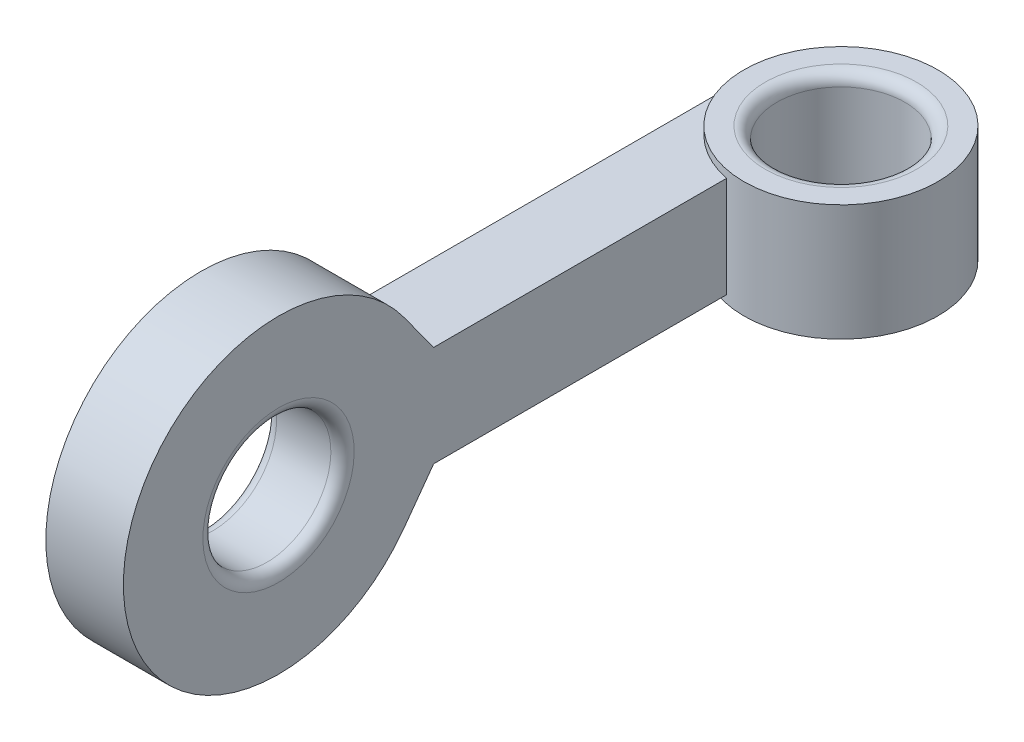
ISO-10303-21;
HEADER;
FILE_DESCRIPTION(('STEP AP214'),'2;1');
FILE_NAME('part.step','',(''),(''),'','','');
FILE_SCHEMA(('AUTOMOTIVE_DESIGN { 1 0 10303 214 1 1 1 1 }'));
ENDSEC;
DATA;
#1=APPLICATION_CONTEXT('core data for automotive mechanical design processes');
#2=APPLICATION_PROTOCOL_DEFINITION('international standard','automotive_design',2000,#1);
#3=PRODUCT_CONTEXT('',#1,'mechanical');
#4=PRODUCT('Part','Part','',(#3));
#5=PRODUCT_RELATED_PRODUCT_CATEGORY('part','',(#4));
#6=PRODUCT_DEFINITION_FORMATION('','',#4);
#7=PRODUCT_DEFINITION_CONTEXT('part definition',#1,'design');
#8=PRODUCT_DEFINITION('design','',#6,#7);
#9=PRODUCT_DEFINITION_SHAPE('','',#8);
#10=(LENGTH_UNIT() NAMED_UNIT(*) SI_UNIT(.MILLI.,.METRE.));
#11=(NAMED_UNIT(*) PLANE_ANGLE_UNIT() SI_UNIT($,.RADIAN.));
#12=(NAMED_UNIT(*) SI_UNIT($,.STERADIAN.) SOLID_ANGLE_UNIT());
#13=UNCERTAINTY_MEASURE_WITH_UNIT(LENGTH_MEASURE(1.E-05),#10,'distance_accuracy_value','');
#14=(GEOMETRIC_REPRESENTATION_CONTEXT(3) GLOBAL_UNCERTAINTY_ASSIGNED_CONTEXT((#13)) GLOBAL_UNIT_ASSIGNED_CONTEXT((#10,
#11,#12)) REPRESENTATION_CONTEXT('',''));
#15=CARTESIAN_POINT('',(0.,0.,0.));
#16=DIRECTION('',(0.,0.,1.));
#17=DIRECTION('',(1.,0.,0.));
#18=AXIS2_PLACEMENT_3D('',#15,#16,#17);
#19=CARTESIAN_POINT('',(0.,3.,0.));
#20=DIRECTION('',(0.,1.,0.));
#21=DIRECTION('',(0.,0.,1.));
#22=AXIS2_PLACEMENT_3D('',#19,#20,#21);
#23=PLANE('',#22);
#24=CARTESIAN_POINT('',(0.,3.,0.));
#25=DIRECTION('',(0.,1.,0.));
#26=DIRECTION('',(0.,0.,1.));
#27=AXIS2_PLACEMENT_3D('',#24,#25,#26);
#28=CIRCLE('',#27,1.95);
#29=CARTESIAN_POINT('',(0.,3.,1.95));
#30=VERTEX_POINT('',#29);
#31=EDGE_CURVE('E182',#30,#30,#28,.F.);
#32=ORIENTED_EDGE('',*,*,#31,.T.);
#33=EDGE_LOOP('',(#32));
#34=FACE_BOUND('',#33,.T.);
#35=CARTESIAN_POINT('',(0.,3.,0.));
#36=DIRECTION('',(0.,1.,0.));
#37=DIRECTION('',(0.,0.,1.));
#38=AXIS2_PLACEMENT_3D('',#35,#36,#37);
#39=CIRCLE('',#38,2.5);
#40=CARTESIAN_POINT('',(0.,3.,2.5));
#41=VERTEX_POINT('',#40);
#42=EDGE_CURVE('E163',#41,#41,#39,.T.);
#43=ORIENTED_EDGE('',*,*,#42,.T.);
#44=EDGE_LOOP('',(#43));
#45=FACE_BOUND('',#44,.T.);
#46=ADVANCED_FACE('F41',(#34,#45),#23,.T.);
#47=CARTESIAN_POINT('',(0.,0.,0.));
#48=DIRECTION('',(0.,1.,0.));
#49=DIRECTION('',(0.,0.,1.));
#50=AXIS2_PLACEMENT_3D('',#47,#48,#49);
#51=PLANE('',#50);
#52=CARTESIAN_POINT('',(0.,0.,0.));
#53=DIRECTION('',(0.,1.,0.));
#54=DIRECTION('',(0.,0.,1.));
#55=AXIS2_PLACEMENT_3D('',#52,#53,#54);
#56=CIRCLE('',#55,1.95);
#57=CARTESIAN_POINT('',(0.,0.,1.95));
#58=VERTEX_POINT('',#57);
#59=EDGE_CURVE('E186',#58,#58,#56,.T.);
#60=ORIENTED_EDGE('',*,*,#59,.T.);
#61=EDGE_LOOP('',(#60));
#62=FACE_BOUND('',#61,.T.);
#63=CARTESIAN_POINT('',(0.,0.,0.));
#64=DIRECTION('',(0.,1.,0.));
#65=DIRECTION('',(0.,0.,1.));
#66=AXIS2_PLACEMENT_3D('',#63,#64,#65);
#67=CIRCLE('',#66,2.5);
#68=CARTESIAN_POINT('',(0.,0.,2.5));
#69=VERTEX_POINT('',#68);
#70=EDGE_CURVE('E146',#69,#69,#67,.T.);
#71=ORIENTED_EDGE('',*,*,#70,.F.);
#72=EDGE_LOOP('',(#71));
#73=FACE_BOUND('',#72,.T.);
#74=ADVANCED_FACE('F210',(#62,#73),#51,.F.);
#75=CARTESIAN_POINT('',(0.,3.,0.));
#76=DIRECTION('',(0.,-1.,0.));
#77=DIRECTION('',(0.,0.,-1.));
#78=AXIS2_PLACEMENT_3D('',#75,#76,#77);
#79=CYLINDRICAL_SURFACE('',#78,2.5);
#80=CARTESIAN_POINT('',(0.,2.8,0.));
#81=DIRECTION('',(0.,1.,0.));
#82=DIRECTION('',(0.,0.,1.));
#83=AXIS2_PLACEMENT_3D('',#80,#81,#82);
#84=CIRCLE('',#83,2.5);
#85=CARTESIAN_POINT('',(-0.5,2.8,2.44948974278318));
#86=VERTEX_POINT('',#85);
#87=CARTESIAN_POINT('',(-2.5,2.8,0.));
#88=VERTEX_POINT('',#87);
#89=EDGE_CURVE('E136',#86,#88,#84,.F.);
#90=ORIENTED_EDGE('',*,*,#89,.F.);
#91=DIRECTION('',(0.,-1.,0.));
#92=VECTOR('',#91,1.);
#93=CARTESIAN_POINT('',(-0.5,3.,2.44948974278318));
#94=LINE('',#93,#92);
#95=CARTESIAN_POINT('',(-0.5,0.2,2.44948974278318));
#96=VERTEX_POINT('',#95);
#97=EDGE_CURVE('E133',#96,#86,#94,.F.);
#98=ORIENTED_EDGE('',*,*,#97,.F.);
#99=CARTESIAN_POINT('',(0.,0.2,0.));
#100=DIRECTION('',(0.,-1.,0.));
#101=DIRECTION('',(1.,0.,0.));
#102=AXIS2_PLACEMENT_3D('',#99,#100,#101);
#103=CIRCLE('',#102,2.5);
#104=CARTESIAN_POINT('',(-2.5,0.2,0.));
#105=VERTEX_POINT('',#104);
#106=EDGE_CURVE('E137',#105,#96,#103,.F.);
#107=ORIENTED_EDGE('',*,*,#106,.F.);
#108=DIRECTION('',(0.,-1.,0.));
#109=VECTOR('',#108,1.);
#110=CARTESIAN_POINT('',(-2.5,3.,0.));
#111=LINE('',#110,#109);
#112=EDGE_CURVE('E132',#105,#88,#111,.F.);
#113=ORIENTED_EDGE('',*,*,#112,.T.);
#114=EDGE_LOOP('',(#90,#98,#107,#113));
#115=FACE_BOUND('',#114,.T.);
#116=ORIENTED_EDGE('',*,*,#42,.F.);
#117=EDGE_LOOP('',(#116));
#118=FACE_BOUND('',#117,.T.);
#119=ORIENTED_EDGE('',*,*,#70,.T.);
#120=EDGE_LOOP('',(#119));
#121=FACE_BOUND('',#120,.T.);
#122=ADVANCED_FACE('F216',(#115,#118,#121),#79,.T.);
#123=CARTESIAN_POINT('',(0.,3.,0.));
#124=DIRECTION('',(0.,-1.,0.));
#125=DIRECTION('',(0.,0.,-1.));
#126=AXIS2_PLACEMENT_3D('',#123,#124,#125);
#127=CYLINDRICAL_SURFACE('',#126,1.65);
#128=CARTESIAN_POINT('',(0.,0.3,0.));
#129=DIRECTION('',(0.,1.,0.));
#130=DIRECTION('',(0.,0.,1.));
#131=AXIS2_PLACEMENT_3D('',#128,#129,#130);
#132=CIRCLE('',#131,1.65);
#133=CARTESIAN_POINT('',(0.,0.3,1.65));
#134=VERTEX_POINT('',#133);
#135=EDGE_CURVE('E190',#134,#134,#132,.F.);
#136=ORIENTED_EDGE('',*,*,#135,.T.);
#137=EDGE_LOOP('',(#136));
#138=FACE_BOUND('',#137,.T.);
#139=CARTESIAN_POINT('',(0.,2.7,0.));
#140=DIRECTION('',(0.,1.,0.));
#141=DIRECTION('',(0.,0.,1.));
#142=AXIS2_PLACEMENT_3D('',#139,#140,#141);
#143=CIRCLE('',#142,1.65);
#144=CARTESIAN_POINT('',(0.,2.7,1.65));
#145=VERTEX_POINT('',#144);
#146=EDGE_CURVE('E178',#145,#145,#143,.T.);
#147=ORIENTED_EDGE('',*,*,#146,.T.);
#148=EDGE_LOOP('',(#147));
#149=FACE_BOUND('',#148,.T.);
#150=ADVANCED_FACE('F221',(#138,#149),#127,.F.);
#151=CARTESIAN_POINT('',(-0.5,2.8,-2.502));
#152=DIRECTION('',(1.,0.,0.));
#153=DIRECTION('',(0.,1.,0.));
#154=AXIS2_PLACEMENT_3D('',#151,#152,#153);
#155=PLANE('',#154);
#156=CARTESIAN_POINT('',(-0.5,1.5,14.));
#157=DIRECTION('',(1.,0.,0.));
#158=DIRECTION('',(0.,1.,0.));
#159=AXIS2_PLACEMENT_3D('',#156,#157,#158);
#160=CIRCLE('',#159,1.95);
#161=CARTESIAN_POINT('',(-0.5,3.45,14.));
#162=VERTEX_POINT('',#161);
#163=EDGE_CURVE('E174',#162,#162,#160,.F.);
#164=ORIENTED_EDGE('',*,*,#163,.T.);
#165=EDGE_LOOP('',(#164));
#166=FACE_BOUND('',#165,.T.);
#167=DIRECTION('',(0.,0.,1.));
#168=VECTOR('',#167,1.);
#169=CARTESIAN_POINT('',(-0.5,0.2,-2.502));
#170=LINE('',#169,#168);
#171=CARTESIAN_POINT('',(-0.5,0.2,10.));
#172=VERTEX_POINT('',#171);
#173=EDGE_CURVE('E151',#96,#172,#170,.T.);
#174=ORIENTED_EDGE('',*,*,#173,.F.);
#175=ORIENTED_EDGE('',*,*,#97,.T.);
#176=DIRECTION('',(0.,0.,1.));
#177=VECTOR('',#176,1.);
#178=CARTESIAN_POINT('',(-0.5,2.8,-2.502));
#179=LINE('',#178,#177);
#180=CARTESIAN_POINT('',(-0.5,2.8,10.));
#181=VERTEX_POINT('',#180);
#182=EDGE_CURVE('E65',#86,#181,#179,.T.);
#183=ORIENTED_EDGE('',*,*,#182,.T.);
#184=DIRECTION('',(0.,-0.808931599773885,-0.587902769926511));
#185=VECTOR('',#184,1.);
#186=CARTESIAN_POINT('',(-0.5,2.8,10.));
#187=LINE('',#186,#185);
#188=CARTESIAN_POINT('',(-0.5,3.85161107970604,10.7642736009045));
#189=VERTEX_POINT('',#188);
#190=EDGE_CURVE('E93',#189,#181,#187,.T.);
#191=ORIENTED_EDGE('',*,*,#190,.F.);
#192=CARTESIAN_POINT('',(-0.5,1.5,14.));
#193=DIRECTION('',(1.,0.,0.));
#194=DIRECTION('',(0.,1.,0.));
#195=AXIS2_PLACEMENT_3D('',#192,#193,#194);
#196=CIRCLE('',#195,4.);
#197=CARTESIAN_POINT('',(-0.5,-0.851611079706041,10.7642736009045));
#198=VERTEX_POINT('',#197);
#199=EDGE_CURVE('E99',#198,#189,#196,.F.);
#200=ORIENTED_EDGE('',*,*,#199,.F.);
#201=DIRECTION('',(0.,-0.808931599773885,0.587902769926511));
#202=VECTOR('',#201,1.);
#203=CARTESIAN_POINT('',(-0.5,0.2,10.));
#204=LINE('',#203,#202);
#205=EDGE_CURVE('E104',#172,#198,#204,.T.);
#206=ORIENTED_EDGE('',*,*,#205,.F.);
#207=EDGE_LOOP('',(#174,#175,#183,#191,#200,#206));
#208=FACE_BOUND('',#207,.T.);
#209=ADVANCED_FACE('F96',(#166,#208),#155,.T.);
#210=CARTESIAN_POINT('',(-2.5,2.8,-2.502));
#211=DIRECTION('',(0.,1.,0.));
#212=DIRECTION('',(0.,0.,1.));
#213=AXIS2_PLACEMENT_3D('',#210,#211,#212);
#214=PLANE('',#213);
#215=ORIENTED_EDGE('',*,*,#182,.F.);
#216=ORIENTED_EDGE('',*,*,#89,.T.);
#217=DIRECTION('',(0.,0.,1.));
#218=VECTOR('',#217,1.);
#219=CARTESIAN_POINT('',(-2.5,2.8,-2.502));
#220=LINE('',#219,#218);
#221=CARTESIAN_POINT('',(-2.5,2.8,10.));
#222=VERTEX_POINT('',#221);
#223=EDGE_CURVE('E142',#88,#222,#220,.T.);
#224=ORIENTED_EDGE('',*,*,#223,.T.);
#225=DIRECTION('',(-1.,0.,0.));
#226=VECTOR('',#225,1.);
#227=CARTESIAN_POINT('',(-2.5,2.8,10.));
#228=LINE('',#227,#226);
#229=EDGE_CURVE('E138',#181,#222,#228,.T.);
#230=ORIENTED_EDGE('',*,*,#229,.F.);
#231=EDGE_LOOP('',(#215,#216,#224,#230));
#232=FACE_BOUND('',#231,.T.);
#233=ADVANCED_FACE('F246',(#232),#214,.T.);
#234=CARTESIAN_POINT('',(-2.5,2.8,-2.502));
#235=DIRECTION('',(-1.,0.,0.));
#236=DIRECTION('',(0.,-1.,0.));
#237=AXIS2_PLACEMENT_3D('',#234,#235,#236);
#238=PLANE('',#237);
#239=CARTESIAN_POINT('',(-2.5,1.5,14.));
#240=DIRECTION('',(-1.,0.,0.));
#241=DIRECTION('',(0.,-1.,0.));
#242=AXIS2_PLACEMENT_3D('',#239,#240,#241);
#243=CIRCLE('',#242,1.95);
#244=CARTESIAN_POINT('',(-2.5,-0.450000000000001,14.));
#245=VERTEX_POINT('',#244);
#246=EDGE_CURVE('E50',#245,#245,#243,.F.);
#247=ORIENTED_EDGE('',*,*,#246,.T.);
#248=EDGE_LOOP('',(#247));
#249=FACE_BOUND('',#248,.T.);
#250=ORIENTED_EDGE('',*,*,#112,.F.);
#251=DIRECTION('',(0.,0.,1.));
#252=VECTOR('',#251,1.);
#253=CARTESIAN_POINT('',(-2.5,0.2,-2.502));
#254=LINE('',#253,#252);
#255=CARTESIAN_POINT('',(-2.5,0.2,10.));
#256=VERTEX_POINT('',#255);
#257=EDGE_CURVE('E57',#105,#256,#254,.T.);
#258=ORIENTED_EDGE('',*,*,#257,.T.);
#259=DIRECTION('',(0.,-0.808931599773884,0.587902769926511));
#260=VECTOR('',#259,1.);
#261=CARTESIAN_POINT('',(-2.5,0.2,10.));
#262=LINE('',#261,#260);
#263=CARTESIAN_POINT('',(-2.5,-0.851611079706041,10.7642736009045));
#264=VERTEX_POINT('',#263);
#265=EDGE_CURVE('E126',#256,#264,#262,.T.);
#266=ORIENTED_EDGE('',*,*,#265,.T.);
#267=CARTESIAN_POINT('',(-2.5,1.5,14.));
#268=DIRECTION('',(-1.,0.,0.));
#269=DIRECTION('',(0.,-1.,0.));
#270=AXIS2_PLACEMENT_3D('',#267,#268,#269);
#271=CIRCLE('',#270,4.);
#272=CARTESIAN_POINT('',(-2.5,3.85161107970604,10.7642736009045));
#273=VERTEX_POINT('',#272);
#274=EDGE_CURVE('E122',#264,#273,#271,.T.);
#275=ORIENTED_EDGE('',*,*,#274,.T.);
#276=DIRECTION('',(0.,-0.808931599773885,-0.58790276992651));
#277=VECTOR('',#276,1.);
#278=CARTESIAN_POINT('',(-2.5,2.8,10.));
#279=LINE('',#278,#277);
#280=EDGE_CURVE('E110',#273,#222,#279,.T.);
#281=ORIENTED_EDGE('',*,*,#280,.T.);
#282=ORIENTED_EDGE('',*,*,#223,.F.);
#283=EDGE_LOOP('',(#250,#258,#266,#275,#281,#282));
#284=FACE_BOUND('',#283,.T.);
#285=ADVANCED_FACE('F197',(#249,#284),#238,.T.);
#286=CARTESIAN_POINT('',(-2.5,0.2,-2.502));
#287=DIRECTION('',(0.,-1.,0.));
#288=DIRECTION('',(1.,0.,0.));
#289=AXIS2_PLACEMENT_3D('',#286,#287,#288);
#290=PLANE('',#289);
#291=ORIENTED_EDGE('',*,*,#257,.F.);
#292=ORIENTED_EDGE('',*,*,#106,.T.);
#293=ORIENTED_EDGE('',*,*,#173,.T.);
#294=DIRECTION('',(1.,0.,0.));
#295=VECTOR('',#294,1.);
#296=CARTESIAN_POINT('',(-2.5,0.2,10.));
#297=LINE('',#296,#295);
#298=EDGE_CURVE('E141',#256,#172,#297,.T.);
#299=ORIENTED_EDGE('',*,*,#298,.F.);
#300=EDGE_LOOP('',(#291,#292,#293,#299));
#301=FACE_BOUND('',#300,.T.);
#302=ADVANCED_FACE('F242',(#301),#290,.T.);
#303=CARTESIAN_POINT('',(10.8137084989848,1.5,14.));
#304=DIRECTION('',(-1.,0.,0.));
#305=DIRECTION('',(0.,-1.,0.));
#306=AXIS2_PLACEMENT_3D('',#303,#304,#305);
#307=CYLINDRICAL_SURFACE('',#306,4.);
#308=DIRECTION('',(-1.,0.,0.));
#309=VECTOR('',#308,1.);
#310=CARTESIAN_POINT('',(10.8137084989848,-0.85161107970604,10.7642736009045));
#311=LINE('',#310,#309);
#312=EDGE_CURVE('E118',#198,#264,#311,.T.);
#313=ORIENTED_EDGE('',*,*,#312,.F.);
#314=ORIENTED_EDGE('',*,*,#199,.T.);
#315=DIRECTION('',(-1.,0.,0.));
#316=VECTOR('',#315,1.);
#317=CARTESIAN_POINT('',(10.8137084989848,3.85161107970604,10.7642736009045));
#318=LINE('',#317,#316);
#319=EDGE_CURVE('E105',#189,#273,#318,.T.);
#320=ORIENTED_EDGE('',*,*,#319,.T.);
#321=ORIENTED_EDGE('',*,*,#274,.F.);
#322=EDGE_LOOP('',(#313,#314,#320,#321));
#323=FACE_BOUND('',#322,.T.);
#324=ADVANCED_FACE('F117',(#323),#307,.T.);
#325=CARTESIAN_POINT('',(10.8137084989848,2.8,10.));
#326=DIRECTION('',(0.,0.587902769926511,-0.808931599773885));
#327=DIRECTION('',(0.,0.808931599773885,0.587902769926511));
#328=AXIS2_PLACEMENT_3D('',#325,#326,#327);
#329=PLANE('',#328);
#330=ORIENTED_EDGE('',*,*,#319,.F.);
#331=ORIENTED_EDGE('',*,*,#190,.T.);
#332=ORIENTED_EDGE('',*,*,#229,.T.);
#333=ORIENTED_EDGE('',*,*,#280,.F.);
#334=EDGE_LOOP('',(#330,#331,#332,#333));
#335=FACE_BOUND('',#334,.T.);
#336=ADVANCED_FACE('F108',(#335),#329,.T.);
#337=CARTESIAN_POINT('',(10.8137084989848,0.200000000000002,10.));
#338=DIRECTION('',(0.,-0.587902769926511,-0.808931599773885));
#339=DIRECTION('',(0.,0.808931599773885,-0.587902769926511));
#340=AXIS2_PLACEMENT_3D('',#337,#338,#339);
#341=PLANE('',#340);
#342=ORIENTED_EDGE('',*,*,#298,.T.);
#343=ORIENTED_EDGE('',*,*,#205,.T.);
#344=ORIENTED_EDGE('',*,*,#312,.T.);
#345=ORIENTED_EDGE('',*,*,#265,.F.);
#346=EDGE_LOOP('',(#342,#343,#344,#345));
#347=FACE_BOUND('',#346,.T.);
#348=ADVANCED_FACE('F272',(#347),#341,.T.);
#349=CARTESIAN_POINT('',(-2.501,1.5,14.));
#350=DIRECTION('',(1.,0.,0.));
#351=DIRECTION('',(0.,1.,0.));
#352=AXIS2_PLACEMENT_3D('',#349,#350,#351);
#353=CYLINDRICAL_SURFACE('',#352,1.65);
#354=CARTESIAN_POINT('',(-2.2,1.5,14.));
#355=DIRECTION('',(-1.,0.,0.));
#356=DIRECTION('',(0.,-1.,0.));
#357=AXIS2_PLACEMENT_3D('',#354,#355,#356);
#358=CIRCLE('',#357,1.65);
#359=CARTESIAN_POINT('',(-2.2,-0.150000000000001,14.));
#360=VERTEX_POINT('',#359);
#361=EDGE_CURVE('E11',#360,#360,#358,.T.);
#362=ORIENTED_EDGE('',*,*,#361,.T.);
#363=EDGE_LOOP('',(#362));
#364=FACE_BOUND('',#363,.T.);
#365=CARTESIAN_POINT('',(-0.8,1.5,14.));
#366=DIRECTION('',(1.,0.,0.));
#367=DIRECTION('',(0.,1.,0.));
#368=AXIS2_PLACEMENT_3D('',#365,#366,#367);
#369=CIRCLE('',#368,1.65);
#370=CARTESIAN_POINT('',(-0.8,3.15,14.));
#371=VERTEX_POINT('',#370);
#372=EDGE_CURVE('E167',#371,#371,#369,.T.);
#373=ORIENTED_EDGE('',*,*,#372,.T.);
#374=EDGE_LOOP('',(#373));
#375=FACE_BOUND('',#374,.T.);
#376=ADVANCED_FACE('F230',(#364,#375),#353,.F.);
#377=CARTESIAN_POINT('',(-0.8,1.5,14.));
#378=DIRECTION('',(1.,0.,0.));
#379=DIRECTION('',(0.,1.,0.));
#380=AXIS2_PLACEMENT_3D('',#377,#378,#379);
#381=TOROIDAL_SURFACE('',#380,1.95,0.3);
#382=ORIENTED_EDGE('',*,*,#163,.F.);
#383=EDGE_LOOP('',(#382));
#384=FACE_BOUND('',#383,.T.);
#385=ORIENTED_EDGE('',*,*,#372,.F.);
#386=EDGE_LOOP('',(#385));
#387=FACE_BOUND('',#386,.T.);
#388=ADVANCED_FACE('F227',(#384,#387),#381,.T.);
#389=CARTESIAN_POINT('',(0.,2.7,0.));
#390=DIRECTION('',(0.,1.,0.));
#391=DIRECTION('',(0.,0.,1.));
#392=AXIS2_PLACEMENT_3D('',#389,#390,#391);
#393=TOROIDAL_SURFACE('',#392,1.95,0.3);
#394=ORIENTED_EDGE('',*,*,#31,.F.);
#395=EDGE_LOOP('',(#394));
#396=FACE_BOUND('',#395,.T.);
#397=ORIENTED_EDGE('',*,*,#146,.F.);
#398=EDGE_LOOP('',(#397));
#399=FACE_BOUND('',#398,.T.);
#400=ADVANCED_FACE('F206',(#396,#399),#393,.T.);
#401=CARTESIAN_POINT('',(0.,0.3,0.));
#402=DIRECTION('',(0.,1.,0.));
#403=DIRECTION('',(0.,0.,1.));
#404=AXIS2_PLACEMENT_3D('',#401,#402,#403);
#405=TOROIDAL_SURFACE('',#404,1.95,0.3);
#406=ORIENTED_EDGE('',*,*,#135,.F.);
#407=EDGE_LOOP('',(#406));
#408=FACE_BOUND('',#407,.T.);
#409=ORIENTED_EDGE('',*,*,#59,.F.);
#410=EDGE_LOOP('',(#409));
#411=FACE_BOUND('',#410,.T.);
#412=ADVANCED_FACE('F201',(#408,#411),#405,.T.);
#413=CARTESIAN_POINT('',(-2.2,1.5,14.));
#414=DIRECTION('',(-1.,0.,0.));
#415=DIRECTION('',(0.,-1.,0.));
#416=AXIS2_PLACEMENT_3D('',#413,#414,#415);
#417=TOROIDAL_SURFACE('',#416,1.95,0.3);
#418=ORIENTED_EDGE('',*,*,#361,.F.);
#419=EDGE_LOOP('',(#418));
#420=FACE_BOUND('',#419,.T.);
#421=ORIENTED_EDGE('',*,*,#246,.F.);
#422=EDGE_LOOP('',(#421));
#423=FACE_BOUND('',#422,.T.);
#424=ADVANCED_FACE('F43',(#420,#423),#417,.T.);
#425=CLOSED_SHELL('',(#46,#74,#122,#150,#209,#233,#285,#302,#324,#336,#348,#376,#388,#400,#412,#424));
#426=MANIFOLD_SOLID_BREP('B2',#425);
#427=ADVANCED_BREP_SHAPE_REPRESENTATION('',(#18,#426),#14);
#428=SHAPE_DEFINITION_REPRESENTATION(#9,#427);
ENDSEC;
END-ISO-10303-21;
